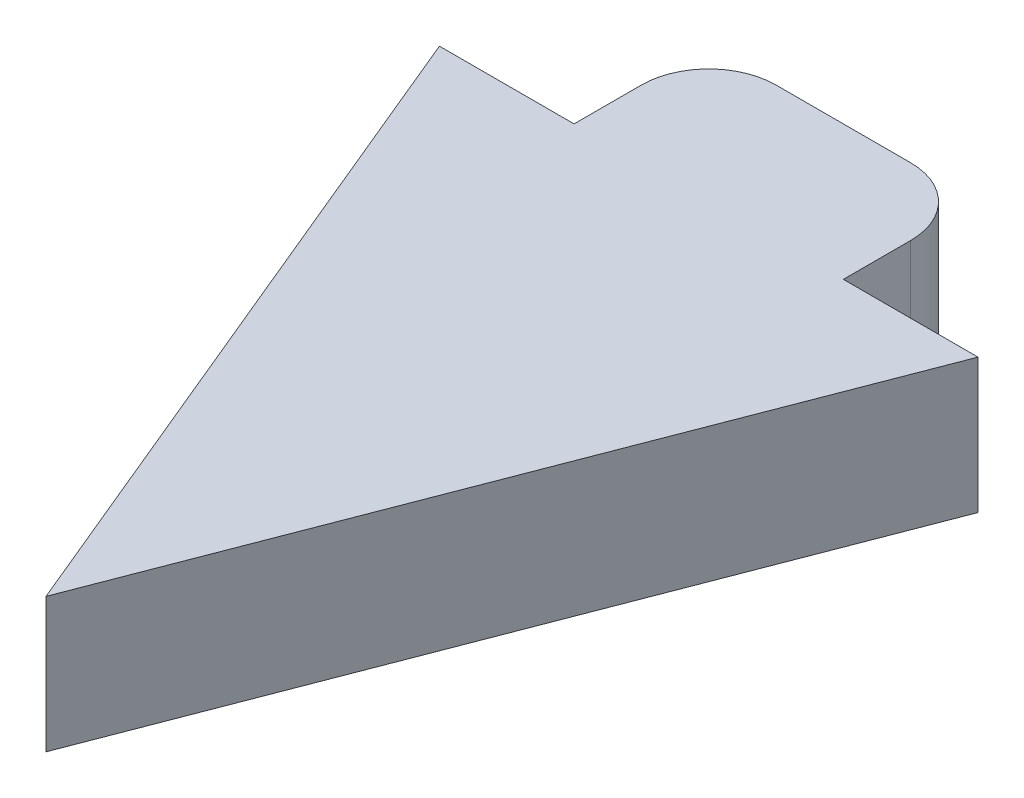
ISO-10303-21;
HEADER;
FILE_DESCRIPTION(('STEP AP214'),'2;1');
FILE_NAME('part.step','',(''),(''),'','','');
FILE_SCHEMA(('AUTOMOTIVE_DESIGN { 1 0 10303 214 1 1 1 1 }'));
ENDSEC;
DATA;
#1=APPLICATION_CONTEXT('core data for automotive mechanical design processes');
#2=APPLICATION_PROTOCOL_DEFINITION('international standard','automotive_design',2000,#1);
#3=PRODUCT_CONTEXT('',#1,'mechanical');
#4=PRODUCT('Part','Part','',(#3));
#5=PRODUCT_RELATED_PRODUCT_CATEGORY('part','',(#4));
#6=PRODUCT_DEFINITION_FORMATION('','',#4);
#7=PRODUCT_DEFINITION_CONTEXT('part definition',#1,'design');
#8=PRODUCT_DEFINITION('design','',#6,#7);
#9=PRODUCT_DEFINITION_SHAPE('','',#8);
#10=(LENGTH_UNIT() NAMED_UNIT(*) SI_UNIT(.MILLI.,.METRE.));
#11=(NAMED_UNIT(*) PLANE_ANGLE_UNIT() SI_UNIT($,.RADIAN.));
#12=(NAMED_UNIT(*) SI_UNIT($,.STERADIAN.) SOLID_ANGLE_UNIT());
#13=UNCERTAINTY_MEASURE_WITH_UNIT(LENGTH_MEASURE(1.E-05),#10,'distance_accuracy_value','');
#14=(GEOMETRIC_REPRESENTATION_CONTEXT(3) GLOBAL_UNCERTAINTY_ASSIGNED_CONTEXT((#13)) GLOBAL_UNIT_ASSIGNED_CONTEXT((#10,
#11,#12)) REPRESENTATION_CONTEXT('',''));
#15=CARTESIAN_POINT('',(0.,0.,0.));
#16=DIRECTION('',(0.,0.,1.));
#17=DIRECTION('',(1.,0.,0.));
#18=AXIS2_PLACEMENT_3D('',#15,#16,#17);
#19=CARTESIAN_POINT('',(19.219343421093,10.,-14.0189873417721));
#20=DIRECTION('',(0.,0.,1.));
#21=DIRECTION('',(1.,0.,0.));
#22=AXIS2_PLACEMENT_3D('',#19,#20,#21);
#23=PLANE('',#22);
#24=DIRECTION('',(-1.,0.,0.));
#25=VECTOR('',#24,1.);
#26=CARTESIAN_POINT('',(19.219343421093,0.,-14.0189873417721));
#27=LINE('',#26,#25);
#28=CARTESIAN_POINT('',(19.219343421093,0.,-14.0189873417721));
#29=VERTEX_POINT('',#28);
#30=CARTESIAN_POINT('',(9.21934342109296,0.,-14.0189873417721));
#31=VERTEX_POINT('',#30);
#32=EDGE_CURVE('E137',#29,#31,#27,.T.);
#33=ORIENTED_EDGE('',*,*,#32,.T.);
#34=DIRECTION('',(0.,-1.,0.));
#35=VECTOR('',#34,1.);
#36=CARTESIAN_POINT('',(9.21934342109296,10.,-14.0189873417721));
#37=LINE('',#36,#35);
#38=CARTESIAN_POINT('',(9.21934342109296,10.,-14.0189873417721));
#39=VERTEX_POINT('',#38);
#40=EDGE_CURVE('E11',#39,#31,#37,.T.);
#41=ORIENTED_EDGE('',*,*,#40,.F.);
#42=DIRECTION('',(-1.,0.,0.));
#43=VECTOR('',#42,1.);
#44=CARTESIAN_POINT('',(19.219343421093,10.,-14.0189873417721));
#45=LINE('',#44,#43);
#46=CARTESIAN_POINT('',(19.219343421093,10.,-14.0189873417721));
#47=VERTEX_POINT('',#46);
#48=EDGE_CURVE('E156',#47,#39,#45,.T.);
#49=ORIENTED_EDGE('',*,*,#48,.F.);
#50=DIRECTION('',(0.,-1.,0.));
#51=VECTOR('',#50,1.);
#52=CARTESIAN_POINT('',(19.219343421093,10.,-14.0189873417721));
#53=LINE('',#52,#51);
#54=EDGE_CURVE('E133',#47,#29,#53,.T.);
#55=ORIENTED_EDGE('',*,*,#54,.T.);
#56=EDGE_LOOP('',(#33,#41,#49,#55));
#57=FACE_BOUND('',#56,.T.);
#58=ADVANCED_FACE('F33',(#57),#23,.F.);
#59=CARTESIAN_POINT('',(9.21934342109296,10.,-19.0189873417721));
#60=DIRECTION('',(-1.,0.,0.));
#61=DIRECTION('',(0.,0.,1.));
#62=AXIS2_PLACEMENT_3D('',#59,#60,#61);
#63=PLANE('',#62);
#64=DIRECTION('',(0.,0.,-1.));
#65=VECTOR('',#64,1.);
#66=CARTESIAN_POINT('',(9.21934342109296,0.,-19.0189873417721));
#67=LINE('',#66,#65);
#68=CARTESIAN_POINT('',(9.21934342109296,0.,-19.0189873417721));
#69=VERTEX_POINT('',#68);
#70=EDGE_CURVE('E140',#31,#69,#67,.T.);
#71=ORIENTED_EDGE('',*,*,#70,.T.);
#72=DIRECTION('',(0.,-1.,0.));
#73=VECTOR('',#72,1.);
#74=CARTESIAN_POINT('',(9.21934342109296,10.,-19.0189873417721));
#75=LINE('',#74,#73);
#76=CARTESIAN_POINT('',(9.21934342109296,10.,-19.0189873417721));
#77=VERTEX_POINT('',#76);
#78=EDGE_CURVE('E41',#77,#69,#75,.T.);
#79=ORIENTED_EDGE('',*,*,#78,.F.);
#80=DIRECTION('',(0.,0.,-1.));
#81=VECTOR('',#80,1.);
#82=CARTESIAN_POINT('',(9.21934342109296,10.,-19.0189873417721));
#83=LINE('',#82,#81);
#84=EDGE_CURVE('E96',#39,#77,#83,.T.);
#85=ORIENTED_EDGE('',*,*,#84,.F.);
#86=ORIENTED_EDGE('',*,*,#40,.T.);
#87=EDGE_LOOP('',(#71,#79,#85,#86));
#88=FACE_BOUND('',#87,.T.);
#89=ADVANCED_FACE('F237',(#88),#63,.F.);
#90=CARTESIAN_POINT('',(4.21934342109296,10.,-19.0189873417721));
#91=DIRECTION('',(0.,-1.,0.));
#92=DIRECTION('',(0.,0.,-1.));
#93=AXIS2_PLACEMENT_3D('',#90,#91,#92);
#94=CYLINDRICAL_SURFACE('',#93,5.);
#95=CARTESIAN_POINT('',(4.21934342109296,0.,-19.0189873417721));
#96=DIRECTION('',(0.,1.,0.));
#97=DIRECTION('',(0.,0.,-1.));
#98=AXIS2_PLACEMENT_3D('',#95,#96,#97);
#99=CIRCLE('',#98,5.);
#100=CARTESIAN_POINT('',(4.21934342109296,0.,-24.0189873417721));
#101=VERTEX_POINT('',#100);
#102=EDGE_CURVE('E143',#69,#101,#99,.T.);
#103=ORIENTED_EDGE('',*,*,#102,.T.);
#104=DIRECTION('',(0.,-1.,0.));
#105=VECTOR('',#104,1.);
#106=CARTESIAN_POINT('',(4.21934342109296,10.,-24.0189873417721));
#107=LINE('',#106,#105);
#108=CARTESIAN_POINT('',(4.21934342109296,10.,-24.0189873417721));
#109=VERTEX_POINT('',#108);
#110=EDGE_CURVE('E166',#109,#101,#107,.T.);
#111=ORIENTED_EDGE('',*,*,#110,.F.);
#112=CARTESIAN_POINT('',(4.21934342109296,10.,-19.0189873417721));
#113=DIRECTION('',(0.,1.,0.));
#114=DIRECTION('',(0.,0.,-1.));
#115=AXIS2_PLACEMENT_3D('',#112,#113,#114);
#116=CIRCLE('',#115,5.);
#117=EDGE_CURVE('E174',#77,#109,#116,.T.);
#118=ORIENTED_EDGE('',*,*,#117,.F.);
#119=ORIENTED_EDGE('',*,*,#78,.T.);
#120=EDGE_LOOP('',(#103,#111,#118,#119));
#121=FACE_BOUND('',#120,.T.);
#122=ADVANCED_FACE('F172',(#121),#94,.T.);
#123=CARTESIAN_POINT('',(-5.78065657890704,10.,-24.0189873417721));
#124=DIRECTION('',(0.,0.,1.));
#125=DIRECTION('',(1.,0.,0.));
#126=AXIS2_PLACEMENT_3D('',#123,#124,#125);
#127=PLANE('',#126);
#128=DIRECTION('',(-1.,0.,0.));
#129=VECTOR('',#128,1.);
#130=CARTESIAN_POINT('',(-5.78065657890704,0.,-24.0189873417721));
#131=LINE('',#130,#129);
#132=CARTESIAN_POINT('',(0.635595912072517,0.,-24.0189873417721));
#133=VERTEX_POINT('',#132);
#134=EDGE_CURVE('E146',#101,#133,#131,.T.);
#135=ORIENTED_EDGE('',*,*,#134,.T.);
#136=CARTESIAN_POINT('',(-5.78065657890704,0.,-24.0189873417721));
#137=VERTEX_POINT('',#136);
#138=EDGE_CURVE('E145',#133,#137,#131,.T.);
#139=ORIENTED_EDGE('',*,*,#138,.T.);
#140=DIRECTION('',(0.,-1.,0.));
#141=VECTOR('',#140,1.);
#142=CARTESIAN_POINT('',(-5.78065657890704,10.,-24.0189873417721));
#143=LINE('',#142,#141);
#144=CARTESIAN_POINT('',(-5.78065657890704,10.,-24.0189873417721));
#145=VERTEX_POINT('',#144);
#146=EDGE_CURVE('E163',#145,#137,#143,.T.);
#147=ORIENTED_EDGE('',*,*,#146,.F.);
#148=DIRECTION('',(-1.,0.,0.));
#149=VECTOR('',#148,1.);
#150=CARTESIAN_POINT('',(-5.78065657890704,10.,-24.0189873417721));
#151=LINE('',#150,#149);
#152=EDGE_CURVE('E196',#109,#145,#151,.T.);
#153=ORIENTED_EDGE('',*,*,#152,.F.);
#154=ORIENTED_EDGE('',*,*,#110,.T.);
#155=EDGE_LOOP('',(#135,#139,#147,#153,#154));
#156=FACE_BOUND('',#155,.T.);
#157=ADVANCED_FACE('F184',(#156),#127,.F.);
#158=CARTESIAN_POINT('',(-5.78065657890704,10.,-19.0189873417721));
#159=DIRECTION('',(0.,-1.,0.));
#160=DIRECTION('',(0.,0.,-1.));
#161=AXIS2_PLACEMENT_3D('',#158,#159,#160);
#162=CYLINDRICAL_SURFACE('',#161,5.);
#163=CARTESIAN_POINT('',(-5.78065657890704,0.,-19.0189873417721));
#164=DIRECTION('',(0.,1.,0.));
#165=DIRECTION('',(0.,0.,1.));
#166=AXIS2_PLACEMENT_3D('',#163,#164,#165);
#167=CIRCLE('',#166,5.);
#168=CARTESIAN_POINT('',(-10.780656578907,0.,-19.0189873417721));
#169=VERTEX_POINT('',#168);
#170=EDGE_CURVE('E149',#137,#169,#167,.T.);
#171=ORIENTED_EDGE('',*,*,#170,.T.);
#172=DIRECTION('',(0.,-1.,0.));
#173=VECTOR('',#172,1.);
#174=CARTESIAN_POINT('',(-10.780656578907,10.,-19.0189873417721));
#175=LINE('',#174,#173);
#176=CARTESIAN_POINT('',(-10.780656578907,10.,-19.0189873417721));
#177=VERTEX_POINT('',#176);
#178=EDGE_CURVE('E160',#177,#169,#175,.T.);
#179=ORIENTED_EDGE('',*,*,#178,.F.);
#180=CARTESIAN_POINT('',(-5.78065657890704,10.,-19.0189873417721));
#181=DIRECTION('',(0.,1.,0.));
#182=DIRECTION('',(0.,0.,1.));
#183=AXIS2_PLACEMENT_3D('',#180,#181,#182);
#184=CIRCLE('',#183,5.);
#185=EDGE_CURVE('E195',#145,#177,#184,.T.);
#186=ORIENTED_EDGE('',*,*,#185,.F.);
#187=ORIENTED_EDGE('',*,*,#146,.T.);
#188=EDGE_LOOP('',(#171,#179,#186,#187));
#189=FACE_BOUND('',#188,.T.);
#190=ADVANCED_FACE('F191',(#189),#162,.T.);
#191=CARTESIAN_POINT('',(-10.780656578907,10.,-14.0189873417721));
#192=DIRECTION('',(1.,0.,0.));
#193=DIRECTION('',(0.,0.,-1.));
#194=AXIS2_PLACEMENT_3D('',#191,#192,#193);
#195=PLANE('',#194);
#196=DIRECTION('',(0.,0.,1.));
#197=VECTOR('',#196,1.);
#198=CARTESIAN_POINT('',(-10.780656578907,0.,-14.0189873417721));
#199=LINE('',#198,#197);
#200=CARTESIAN_POINT('',(-10.780656578907,0.,-14.0189873417721));
#201=VERTEX_POINT('',#200);
#202=EDGE_CURVE('E151',#169,#201,#199,.T.);
#203=ORIENTED_EDGE('',*,*,#202,.T.);
#204=DIRECTION('',(0.,-1.,0.));
#205=VECTOR('',#204,1.);
#206=CARTESIAN_POINT('',(-10.780656578907,10.,-14.0189873417721));
#207=LINE('',#206,#205);
#208=CARTESIAN_POINT('',(-10.780656578907,10.,-14.0189873417721));
#209=VERTEX_POINT('',#208);
#210=EDGE_CURVE('E128',#209,#201,#207,.T.);
#211=ORIENTED_EDGE('',*,*,#210,.F.);
#212=DIRECTION('',(0.,0.,1.));
#213=VECTOR('',#212,1.);
#214=CARTESIAN_POINT('',(-10.780656578907,10.,-14.0189873417721));
#215=LINE('',#214,#213);
#216=EDGE_CURVE('E119',#177,#209,#215,.T.);
#217=ORIENTED_EDGE('',*,*,#216,.F.);
#218=ORIENTED_EDGE('',*,*,#178,.T.);
#219=EDGE_LOOP('',(#203,#211,#217,#218));
#220=FACE_BOUND('',#219,.T.);
#221=ADVANCED_FACE('F194',(#220),#195,.F.);
#222=CARTESIAN_POINT('',(-10.780656578907,10.,-14.0189873417721));
#223=DIRECTION('',(0.,0.,1.));
#224=DIRECTION('',(1.,0.,0.));
#225=AXIS2_PLACEMENT_3D('',#222,#223,#224);
#226=PLANE('',#225);
#227=DIRECTION('',(-1.,0.,0.));
#228=VECTOR('',#227,1.);
#229=CARTESIAN_POINT('',(-10.780656578907,0.,-14.0189873417721));
#230=LINE('',#229,#228);
#231=CARTESIAN_POINT('',(-20.780656578907,0.,-14.0189873417721));
#232=VERTEX_POINT('',#231);
#233=EDGE_CURVE('E127',#201,#232,#230,.T.);
#234=ORIENTED_EDGE('',*,*,#233,.T.);
#235=DIRECTION('',(0.,-1.,0.));
#236=VECTOR('',#235,1.);
#237=CARTESIAN_POINT('',(-20.780656578907,10.,-14.0189873417721));
#238=LINE('',#237,#236);
#239=CARTESIAN_POINT('',(-20.780656578907,10.,-14.0189873417721));
#240=VERTEX_POINT('',#239);
#241=EDGE_CURVE('E124',#240,#232,#238,.T.);
#242=ORIENTED_EDGE('',*,*,#241,.F.);
#243=DIRECTION('',(-1.,0.,0.));
#244=VECTOR('',#243,1.);
#245=CARTESIAN_POINT('',(-10.780656578907,10.,-14.0189873417721));
#246=LINE('',#245,#244);
#247=EDGE_CURVE('E113',#209,#240,#246,.T.);
#248=ORIENTED_EDGE('',*,*,#247,.F.);
#249=ORIENTED_EDGE('',*,*,#210,.T.);
#250=EDGE_LOOP('',(#234,#242,#248,#249));
#251=FACE_BOUND('',#250,.T.);
#252=ADVANCED_FACE('F125',(#251),#226,.F.);
#253=CARTESIAN_POINT('',(-20.780656578907,10.,-14.0189873417721));
#254=DIRECTION('',(0.923421944038664,0.,-0.383786285929884));
#255=DIRECTION('',(-0.383786285929884,0.,-0.923421944038664));
#256=AXIS2_PLACEMENT_3D('',#253,#254,#255);
#257=PLANE('',#256);
#258=DIRECTION('',(0.383786285929884,0.,0.923421944038664));
#259=VECTOR('',#258,1.);
#260=CARTESIAN_POINT('',(-20.780656578907,0.,-14.0189873417721));
#261=LINE('',#260,#259);
#262=CARTESIAN_POINT('',(0.,0.,35.9810126582279));
#263=VERTEX_POINT('',#262);
#264=EDGE_CURVE('E82',#232,#263,#261,.T.);
#265=ORIENTED_EDGE('',*,*,#264,.T.);
#266=DIRECTION('',(0.,-1.,0.));
#267=VECTOR('',#266,1.);
#268=CARTESIAN_POINT('',(0.,10.,35.9810126582279));
#269=LINE('',#268,#267);
#270=CARTESIAN_POINT('',(0.,10.,35.9810126582279));
#271=VERTEX_POINT('',#270);
#272=EDGE_CURVE('E129',#271,#263,#269,.T.);
#273=ORIENTED_EDGE('',*,*,#272,.F.);
#274=DIRECTION('',(0.383786285929884,0.,0.923421944038664));
#275=VECTOR('',#274,1.);
#276=CARTESIAN_POINT('',(-20.780656578907,10.,-14.0189873417721));
#277=LINE('',#276,#275);
#278=EDGE_CURVE('E117',#240,#271,#277,.T.);
#279=ORIENTED_EDGE('',*,*,#278,.F.);
#280=ORIENTED_EDGE('',*,*,#241,.T.);
#281=EDGE_LOOP('',(#265,#273,#279,#280));
#282=FACE_BOUND('',#281,.T.);
#283=ADVANCED_FACE('F131',(#282),#257,.F.);
#284=CARTESIAN_POINT('',(0.,10.,35.9810126582279));
#285=DIRECTION('',(-0.933417054507345,0.,-0.358793258513634));
#286=DIRECTION('',(-0.358793258513634,0.,0.933417054507345));
#287=AXIS2_PLACEMENT_3D('',#284,#285,#286);
#288=PLANE('',#287);
#289=DIRECTION('',(0.358793258513634,0.,-0.933417054507345));
#290=VECTOR('',#289,1.);
#291=CARTESIAN_POINT('',(0.,0.,35.9810126582279));
#292=LINE('',#291,#290);
#293=EDGE_CURVE('E88',#263,#29,#292,.T.);
#294=ORIENTED_EDGE('',*,*,#293,.T.);
#295=ORIENTED_EDGE('',*,*,#54,.F.);
#296=DIRECTION('',(0.358793258513634,0.,-0.933417054507345));
#297=VECTOR('',#296,1.);
#298=CARTESIAN_POINT('',(0.,10.,35.9810126582279));
#299=LINE('',#298,#297);
#300=EDGE_CURVE('E49',#271,#47,#299,.T.);
#301=ORIENTED_EDGE('',*,*,#300,.F.);
#302=ORIENTED_EDGE('',*,*,#272,.T.);
#303=EDGE_LOOP('',(#294,#295,#301,#302));
#304=FACE_BOUND('',#303,.T.);
#305=ADVANCED_FACE('F244',(#304),#288,.F.);
#306=CARTESIAN_POINT('',(4.21934342109296,10.,-19.0189873417721));
#307=DIRECTION('',(0.,-1.,0.));
#308=DIRECTION('',(0.,0.,-1.));
#309=AXIS2_PLACEMENT_3D('',#306,#307,#308);
#310=PLANE('',#309);
#311=ORIENTED_EDGE('',*,*,#48,.T.);
#312=ORIENTED_EDGE('',*,*,#84,.T.);
#313=ORIENTED_EDGE('',*,*,#117,.T.);
#314=ORIENTED_EDGE('',*,*,#152,.T.);
#315=ORIENTED_EDGE('',*,*,#185,.T.);
#316=ORIENTED_EDGE('',*,*,#216,.T.);
#317=ORIENTED_EDGE('',*,*,#247,.T.);
#318=ORIENTED_EDGE('',*,*,#278,.T.);
#319=ORIENTED_EDGE('',*,*,#300,.T.);
#320=EDGE_LOOP('',(#311,#312,#313,#314,#315,#316,#317,#318,#319));
#321=FACE_BOUND('',#320,.T.);
#322=ADVANCED_FACE('F115',(#321),#310,.F.);
#323=CARTESIAN_POINT('',(4.21934342109296,0.,-19.0189873417721));
#324=DIRECTION('',(0.,-1.,0.));
#325=DIRECTION('',(0.,0.,-1.));
#326=AXIS2_PLACEMENT_3D('',#323,#324,#325);
#327=PLANE('',#326);
#328=ORIENTED_EDGE('',*,*,#138,.F.);
#329=CARTESIAN_POINT('',(0.635595912072517,0.,-21.0189873417721));
#330=DIRECTION('',(0.,-1.,0.));
#331=DIRECTION('',(0.,0.,-1.));
#332=AXIS2_PLACEMENT_3D('',#329,#330,#331);
#333=CIRCLE('',#332,3.);
#334=EDGE_CURVE('E182',#133,#133,#333,.T.);
#335=ORIENTED_EDGE('',*,*,#334,.F.);
#336=ORIENTED_EDGE('',*,*,#134,.F.);
#337=ORIENTED_EDGE('',*,*,#102,.F.);
#338=ORIENTED_EDGE('',*,*,#70,.F.);
#339=ORIENTED_EDGE('',*,*,#32,.F.);
#340=ORIENTED_EDGE('',*,*,#293,.F.);
#341=ORIENTED_EDGE('',*,*,#264,.F.);
#342=ORIENTED_EDGE('',*,*,#233,.F.);
#343=ORIENTED_EDGE('',*,*,#202,.F.);
#344=ORIENTED_EDGE('',*,*,#170,.F.);
#345=EDGE_LOOP('',(#328,#335,#336,#337,#338,#339,#340,#341,#342,#343,#344));
#346=FACE_BOUND('',#345,.T.);
#347=ADVANCED_FACE('F178',(#346),#327,.T.);
#348=CARTESIAN_POINT('',(0.635595912072517,-5.,-21.0189873417721));
#349=DIRECTION('',(0.,1.,0.));
#350=DIRECTION('',(0.,0.,1.));
#351=AXIS2_PLACEMENT_3D('',#348,#349,#350);
#352=CYLINDRICAL_SURFACE('',#351,3.);
#353=CARTESIAN_POINT('',(0.635595912072517,-5.,-21.0189873417721));
#354=DIRECTION('',(0.,-1.,0.));
#355=DIRECTION('',(0.,0.,-1.));
#356=AXIS2_PLACEMENT_3D('',#353,#354,#355);
#357=CIRCLE('',#356,3.);
#358=CARTESIAN_POINT('',(0.635595912072517,-5.,-24.0189873417721));
#359=VERTEX_POINT('',#358);
#360=EDGE_CURVE('E141',#359,#359,#357,.T.);
#361=ORIENTED_EDGE('',*,*,#360,.F.);
#362=EDGE_LOOP('',(#361));
#363=FACE_BOUND('',#362,.T.);
#364=ORIENTED_EDGE('',*,*,#334,.T.);
#365=EDGE_LOOP('',(#364));
#366=FACE_BOUND('',#365,.T.);
#367=ADVANCED_FACE('F224',(#363,#366),#352,.T.);
#368=CARTESIAN_POINT('',(0.635595912072517,-5.,-21.0189873417721));
#369=DIRECTION('',(0.,-1.,0.));
#370=DIRECTION('',(0.,0.,-1.));
#371=AXIS2_PLACEMENT_3D('',#368,#369,#370);
#372=PLANE('',#371);
#373=CARTESIAN_POINT('',(0.635595912072517,-5.,-21.0189873417721));
#374=DIRECTION('',(0.,-1.,0.));
#375=DIRECTION('',(0.,0.,-1.));
#376=AXIS2_PLACEMENT_3D('',#373,#374,#375);
#377=CIRCLE('',#376,1.778);
#378=CARTESIAN_POINT('',(0.635595912072517,-5.,-22.7969873417721));
#379=VERTEX_POINT('',#378);
#380=EDGE_CURVE('E207',#379,#379,#377,.T.);
#381=ORIENTED_EDGE('',*,*,#380,.F.);
#382=EDGE_LOOP('',(#381));
#383=FACE_BOUND('',#382,.T.);
#384=ORIENTED_EDGE('',*,*,#360,.T.);
#385=EDGE_LOOP('',(#384));
#386=FACE_BOUND('',#385,.T.);
#387=ADVANCED_FACE('F218',(#383,#386),#372,.T.);
#388=CARTESIAN_POINT('',(0.635595912072517,0.,-21.0189873417721));
#389=DIRECTION('',(0.,-1.,0.));
#390=DIRECTION('',(0.,0.,-1.));
#391=AXIS2_PLACEMENT_3D('',#388,#389,#390);
#392=CYLINDRICAL_SURFACE('',#391,1.778);
#393=CARTESIAN_POINT('',(0.635595912072517,0.,-21.0189873417721));
#394=DIRECTION('',(0.,-1.,0.));
#395=DIRECTION('',(0.,0.,-1.));
#396=AXIS2_PLACEMENT_3D('',#393,#394,#395);
#397=CIRCLE('',#396,1.778);
#398=CARTESIAN_POINT('',(0.635595912072517,0.,-22.7969873417721));
#399=VERTEX_POINT('',#398);
#400=EDGE_CURVE('E204',#399,#399,#397,.T.);
#401=ORIENTED_EDGE('',*,*,#400,.F.);
#402=EDGE_LOOP('',(#401));
#403=FACE_BOUND('',#402,.T.);
#404=ORIENTED_EDGE('',*,*,#380,.T.);
#405=EDGE_LOOP('',(#404));
#406=FACE_BOUND('',#405,.T.);
#407=ADVANCED_FACE('F215',(#403,#406),#392,.F.);
#408=CARTESIAN_POINT('',(0.635595912072517,0.,-21.0189873417721));
#409=DIRECTION('',(0.,-1.,0.));
#410=DIRECTION('',(0.,0.,-1.));
#411=AXIS2_PLACEMENT_3D('',#408,#409,#410);
#412=PLANE('',#411);
#413=ORIENTED_EDGE('',*,*,#400,.T.);
#414=EDGE_LOOP('',(#413));
#415=FACE_BOUND('',#414,.T.);
#416=ADVANCED_FACE('F213',(#415),#412,.T.);
#417=CLOSED_SHELL('',(#58,#89,#122,#157,#190,#221,#252,#283,#305,#322,#347,#367,#387,#407,#416));
#418=MANIFOLD_SOLID_BREP('B2',#417);
#419=ADVANCED_BREP_SHAPE_REPRESENTATION('',(#18,#418),#14);
#420=SHAPE_DEFINITION_REPRESENTATION(#9,#419);
ENDSEC;
END-ISO-10303-21;
